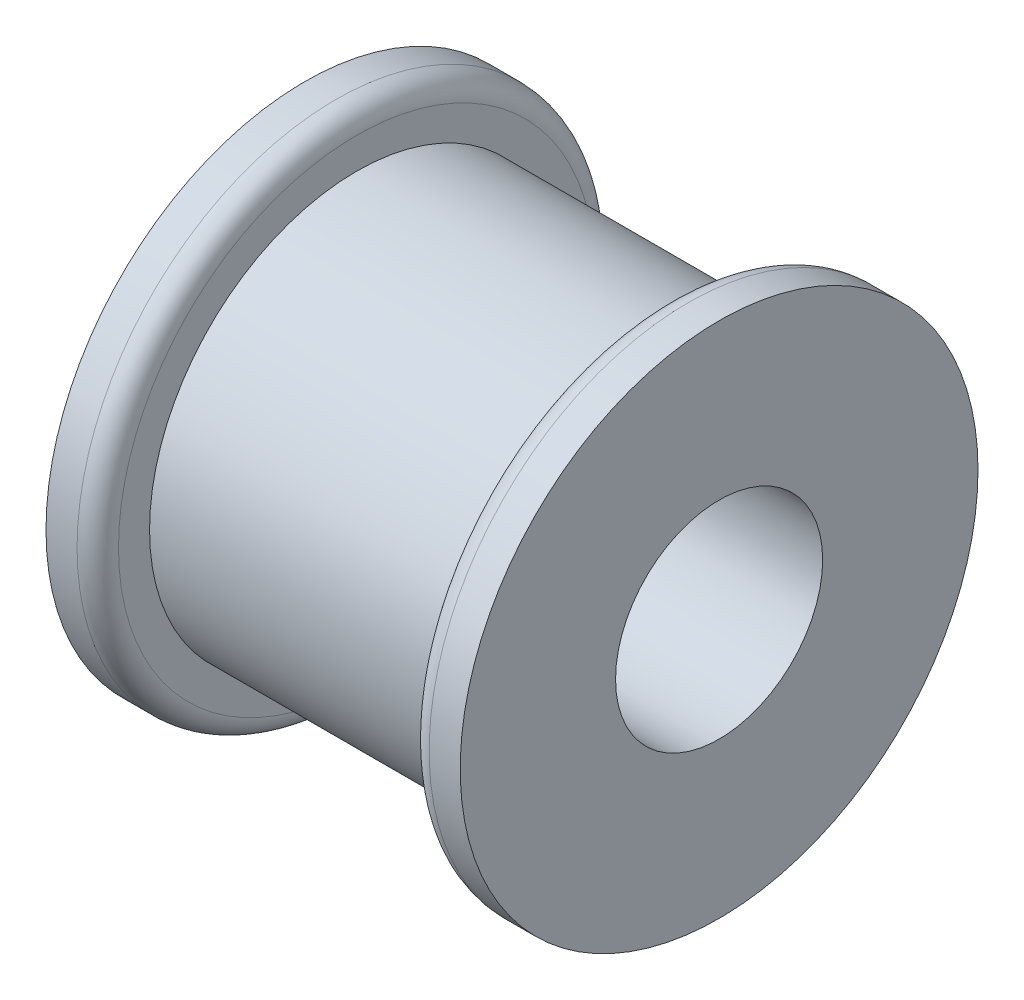
ISO-10303-21;
HEADER;
FILE_DESCRIPTION(('STEP AP214'),'2;1');
FILE_NAME('part.step','',(''),(''),'','','');
FILE_SCHEMA(('AUTOMOTIVE_DESIGN { 1 0 10303 214 1 1 1 1 }'));
ENDSEC;
DATA;
#1=APPLICATION_CONTEXT('core data for automotive mechanical design processes');
#2=APPLICATION_PROTOCOL_DEFINITION('international standard','automotive_design',2000,#1);
#3=PRODUCT_CONTEXT('',#1,'mechanical');
#4=PRODUCT('Part','Part','',(#3));
#5=PRODUCT_RELATED_PRODUCT_CATEGORY('part','',(#4));
#6=PRODUCT_DEFINITION_FORMATION('','',#4);
#7=PRODUCT_DEFINITION_CONTEXT('part definition',#1,'design');
#8=PRODUCT_DEFINITION('design','',#6,#7);
#9=PRODUCT_DEFINITION_SHAPE('','',#8);
#10=(LENGTH_UNIT() NAMED_UNIT(*) SI_UNIT(.MILLI.,.METRE.));
#11=(NAMED_UNIT(*) PLANE_ANGLE_UNIT() SI_UNIT($,.RADIAN.));
#12=(NAMED_UNIT(*) SI_UNIT($,.STERADIAN.) SOLID_ANGLE_UNIT());
#13=UNCERTAINTY_MEASURE_WITH_UNIT(LENGTH_MEASURE(1.E-05),#10,'distance_accuracy_value','');
#14=(GEOMETRIC_REPRESENTATION_CONTEXT(3) GLOBAL_UNCERTAINTY_ASSIGNED_CONTEXT((#13)) GLOBAL_UNIT_ASSIGNED_CONTEXT((#10,
#11,#12)) REPRESENTATION_CONTEXT('',''));
#15=CARTESIAN_POINT('',(0.,0.,0.));
#16=DIRECTION('',(0.,0.,1.));
#17=DIRECTION('',(1.,0.,0.));
#18=AXIS2_PLACEMENT_3D('',#15,#16,#17);
#19=CARTESIAN_POINT('',(19.05,0.,0.));
#20=DIRECTION('',(-1.,0.,0.));
#21=DIRECTION('',(0.,0.,1.));
#22=AXIS2_PLACEMENT_3D('',#19,#20,#21);
#23=CYLINDRICAL_SURFACE('',#22,12.7);
#24=CARTESIAN_POINT('',(19.05,0.,0.));
#25=DIRECTION('',(1.,0.,0.));
#26=DIRECTION('',(0.,0.,-1.));
#27=AXIS2_PLACEMENT_3D('',#24,#25,#26);
#28=CIRCLE('',#27,12.7);
#29=CARTESIAN_POINT('',(19.05,0.,-12.7));
#30=VERTEX_POINT('',#29);
#31=EDGE_CURVE('E59',#30,#30,#28,.T.);
#32=ORIENTED_EDGE('',*,*,#31,.F.);
#33=EDGE_LOOP('',(#32));
#34=FACE_BOUND('',#33,.T.);
#35=CARTESIAN_POINT('',(0.,0.,0.));
#36=DIRECTION('',(1.,0.,0.));
#37=DIRECTION('',(0.,0.,-1.));
#38=AXIS2_PLACEMENT_3D('',#35,#36,#37);
#39=CIRCLE('',#38,12.7);
#40=CARTESIAN_POINT('',(0.,0.,-12.7));
#41=VERTEX_POINT('',#40);
#42=EDGE_CURVE('E60',#41,#41,#39,.T.);
#43=ORIENTED_EDGE('',*,*,#42,.T.);
#44=EDGE_LOOP('',(#43));
#45=FACE_BOUND('',#44,.T.);
#46=ADVANCED_FACE('F34',(#34,#45),#23,.T.);
#47=CARTESIAN_POINT('',(-3.175,0.,0.));
#48=DIRECTION('',(1.,0.,0.));
#49=DIRECTION('',(0.,0.,-1.));
#50=AXIS2_PLACEMENT_3D('',#47,#48,#49);
#51=CYLINDRICAL_SURFACE('',#50,15.875);
#52=CARTESIAN_POINT('',(-1.27,0.,0.));
#53=DIRECTION('',(-1.,0.,0.));
#54=DIRECTION('',(0.,0.,1.));
#55=AXIS2_PLACEMENT_3D('',#52,#53,#54);
#56=CIRCLE('',#55,15.875);
#57=CARTESIAN_POINT('',(-1.27,0.,15.875));
#58=VERTEX_POINT('',#57);
#59=EDGE_CURVE('E54',#58,#58,#56,.T.);
#60=ORIENTED_EDGE('',*,*,#59,.T.);
#61=EDGE_LOOP('',(#60));
#62=FACE_BOUND('',#61,.T.);
#63=CARTESIAN_POINT('',(-3.175,0.,0.));
#64=DIRECTION('',(-1.,0.,0.));
#65=DIRECTION('',(0.,0.,1.));
#66=AXIS2_PLACEMENT_3D('',#63,#64,#65);
#67=CIRCLE('',#66,15.875);
#68=CARTESIAN_POINT('',(-3.175,0.,15.875));
#69=VERTEX_POINT('',#68);
#70=EDGE_CURVE('E64',#69,#69,#67,.T.);
#71=ORIENTED_EDGE('',*,*,#70,.F.);
#72=EDGE_LOOP('',(#71));
#73=FACE_BOUND('',#72,.T.);
#74=ADVANCED_FACE('F98',(#62,#73),#51,.T.);
#75=CARTESIAN_POINT('',(-3.175,0.,0.));
#76=DIRECTION('',(-1.,0.,0.));
#77=DIRECTION('',(0.,0.,1.));
#78=AXIS2_PLACEMENT_3D('',#75,#76,#77);
#79=PLANE('',#78);
#80=CARTESIAN_POINT('',(-3.175,0.,0.));
#81=DIRECTION('',(-1.,0.,0.));
#82=DIRECTION('',(0.,0.,1.));
#83=AXIS2_PLACEMENT_3D('',#80,#81,#82);
#84=CIRCLE('',#83,6.35);
#85=CARTESIAN_POINT('',(-3.175,0.,6.35));
#86=VERTEX_POINT('',#85);
#87=EDGE_CURVE('E75',#86,#86,#84,.T.);
#88=ORIENTED_EDGE('',*,*,#87,.F.);
#89=EDGE_LOOP('',(#88));
#90=FACE_BOUND('',#89,.T.);
#91=ORIENTED_EDGE('',*,*,#70,.T.);
#92=EDGE_LOOP('',(#91));
#93=FACE_BOUND('',#92,.T.);
#94=ADVANCED_FACE('F94',(#90,#93),#79,.T.);
#95=CARTESIAN_POINT('',(0.,0.,0.));
#96=DIRECTION('',(-1.,0.,0.));
#97=DIRECTION('',(0.,0.,1.));
#98=AXIS2_PLACEMENT_3D('',#95,#96,#97);
#99=PLANE('',#98);
#100=CARTESIAN_POINT('',(0.,0.,0.));
#101=DIRECTION('',(-1.,0.,0.));
#102=DIRECTION('',(0.,0.,1.));
#103=AXIS2_PLACEMENT_3D('',#100,#101,#102);
#104=CIRCLE('',#103,14.605);
#105=CARTESIAN_POINT('',(0.,0.,14.605));
#106=VERTEX_POINT('',#105);
#107=EDGE_CURVE('E48',#106,#106,#104,.F.);
#108=ORIENTED_EDGE('',*,*,#107,.T.);
#109=EDGE_LOOP('',(#108));
#110=FACE_BOUND('',#109,.T.);
#111=ORIENTED_EDGE('',*,*,#42,.F.);
#112=EDGE_LOOP('',(#111));
#113=FACE_BOUND('',#112,.T.);
#114=ADVANCED_FACE('F97',(#110,#113),#99,.F.);
#115=CARTESIAN_POINT('',(22.225,0.,0.));
#116=DIRECTION('',(-1.,0.,0.));
#117=DIRECTION('',(0.,0.,1.));
#118=AXIS2_PLACEMENT_3D('',#115,#116,#117);
#119=CYLINDRICAL_SURFACE('',#118,15.875);
#120=CARTESIAN_POINT('',(20.32,0.,0.));
#121=DIRECTION('',(1.,0.,0.));
#122=DIRECTION('',(0.,0.,-1.));
#123=AXIS2_PLACEMENT_3D('',#120,#121,#122);
#124=CIRCLE('',#123,15.875);
#125=CARTESIAN_POINT('',(20.32,0.,-15.875));
#126=VERTEX_POINT('',#125);
#127=EDGE_CURVE('E42',#126,#126,#124,.T.);
#128=ORIENTED_EDGE('',*,*,#127,.T.);
#129=EDGE_LOOP('',(#128));
#130=FACE_BOUND('',#129,.T.);
#131=CARTESIAN_POINT('',(22.225,0.,0.));
#132=DIRECTION('',(1.,0.,0.));
#133=DIRECTION('',(0.,0.,-1.));
#134=AXIS2_PLACEMENT_3D('',#131,#132,#133);
#135=CIRCLE('',#134,15.875);
#136=CARTESIAN_POINT('',(22.225,0.,-15.875));
#137=VERTEX_POINT('',#136);
#138=EDGE_CURVE('E71',#137,#137,#135,.T.);
#139=ORIENTED_EDGE('',*,*,#138,.F.);
#140=EDGE_LOOP('',(#139));
#141=FACE_BOUND('',#140,.T.);
#142=ADVANCED_FACE('F123',(#130,#141),#119,.T.);
#143=CARTESIAN_POINT('',(22.225,0.,0.));
#144=DIRECTION('',(1.,0.,0.));
#145=DIRECTION('',(0.,0.,-1.));
#146=AXIS2_PLACEMENT_3D('',#143,#144,#145);
#147=PLANE('',#146);
#148=CARTESIAN_POINT('',(22.225,0.,0.));
#149=DIRECTION('',(-1.,0.,0.));
#150=DIRECTION('',(0.,0.,1.));
#151=AXIS2_PLACEMENT_3D('',#148,#149,#150);
#152=CIRCLE('',#151,6.35);
#153=CARTESIAN_POINT('',(22.225,0.,6.35));
#154=VERTEX_POINT('',#153);
#155=EDGE_CURVE('E74',#154,#154,#152,.T.);
#156=ORIENTED_EDGE('',*,*,#155,.T.);
#157=EDGE_LOOP('',(#156));
#158=FACE_BOUND('',#157,.T.);
#159=ORIENTED_EDGE('',*,*,#138,.T.);
#160=EDGE_LOOP('',(#159));
#161=FACE_BOUND('',#160,.T.);
#162=ADVANCED_FACE('F83',(#158,#161),#147,.T.);
#163=CARTESIAN_POINT('',(19.05,0.,0.));
#164=DIRECTION('',(1.,0.,0.));
#165=DIRECTION('',(0.,0.,-1.));
#166=AXIS2_PLACEMENT_3D('',#163,#164,#165);
#167=PLANE('',#166);
#168=CARTESIAN_POINT('',(19.05,0.,0.));
#169=DIRECTION('',(1.,0.,0.));
#170=DIRECTION('',(0.,0.,-1.));
#171=AXIS2_PLACEMENT_3D('',#168,#169,#170);
#172=CIRCLE('',#171,14.605);
#173=CARTESIAN_POINT('',(19.05,0.,-14.605));
#174=VERTEX_POINT('',#173);
#175=EDGE_CURVE('E10',#174,#174,#172,.F.);
#176=ORIENTED_EDGE('',*,*,#175,.T.);
#177=EDGE_LOOP('',(#176));
#178=FACE_BOUND('',#177,.T.);
#179=ORIENTED_EDGE('',*,*,#31,.T.);
#180=EDGE_LOOP('',(#179));
#181=FACE_BOUND('',#180,.T.);
#182=ADVANCED_FACE('F90',(#178,#181),#167,.F.);
#183=CARTESIAN_POINT('',(22.225,0.,0.));
#184=DIRECTION('',(-1.,0.,0.));
#185=DIRECTION('',(0.,0.,1.));
#186=AXIS2_PLACEMENT_3D('',#183,#184,#185);
#187=CYLINDRICAL_SURFACE('',#186,6.35);
#188=ORIENTED_EDGE('',*,*,#155,.F.);
#189=EDGE_LOOP('',(#188));
#190=FACE_BOUND('',#189,.T.);
#191=ORIENTED_EDGE('',*,*,#87,.T.);
#192=EDGE_LOOP('',(#191));
#193=FACE_BOUND('',#192,.T.);
#194=ADVANCED_FACE('F86',(#190,#193),#187,.F.);
#195=CARTESIAN_POINT('',(-1.27,0.,0.));
#196=DIRECTION('',(-1.,0.,0.));
#197=DIRECTION('',(0.,0.,1.));
#198=AXIS2_PLACEMENT_3D('',#195,#196,#197);
#199=TOROIDAL_SURFACE('',#198,14.605,1.27);
#200=ORIENTED_EDGE('',*,*,#107,.F.);
#201=EDGE_LOOP('',(#200));
#202=FACE_BOUND('',#201,.T.);
#203=ORIENTED_EDGE('',*,*,#59,.F.);
#204=EDGE_LOOP('',(#203));
#205=FACE_BOUND('',#204,.T.);
#206=ADVANCED_FACE('F89',(#202,#205),#199,.T.);
#207=CARTESIAN_POINT('',(20.32,0.,0.));
#208=DIRECTION('',(1.,0.,0.));
#209=DIRECTION('',(0.,0.,-1.));
#210=AXIS2_PLACEMENT_3D('',#207,#208,#209);
#211=TOROIDAL_SURFACE('',#210,14.605,1.27);
#212=ORIENTED_EDGE('',*,*,#175,.F.);
#213=EDGE_LOOP('',(#212));
#214=FACE_BOUND('',#213,.T.);
#215=ORIENTED_EDGE('',*,*,#127,.F.);
#216=EDGE_LOOP('',(#215));
#217=FACE_BOUND('',#216,.T.);
#218=ADVANCED_FACE('F36',(#214,#217),#211,.T.);
#219=CLOSED_SHELL('',(#46,#74,#94,#114,#142,#162,#182,#194,#206,#218));
#220=MANIFOLD_SOLID_BREP('B2',#219);
#221=ADVANCED_BREP_SHAPE_REPRESENTATION('',(#18,#220),#14);
#222=SHAPE_DEFINITION_REPRESENTATION(#9,#221);
ENDSEC;
END-ISO-10303-21;
